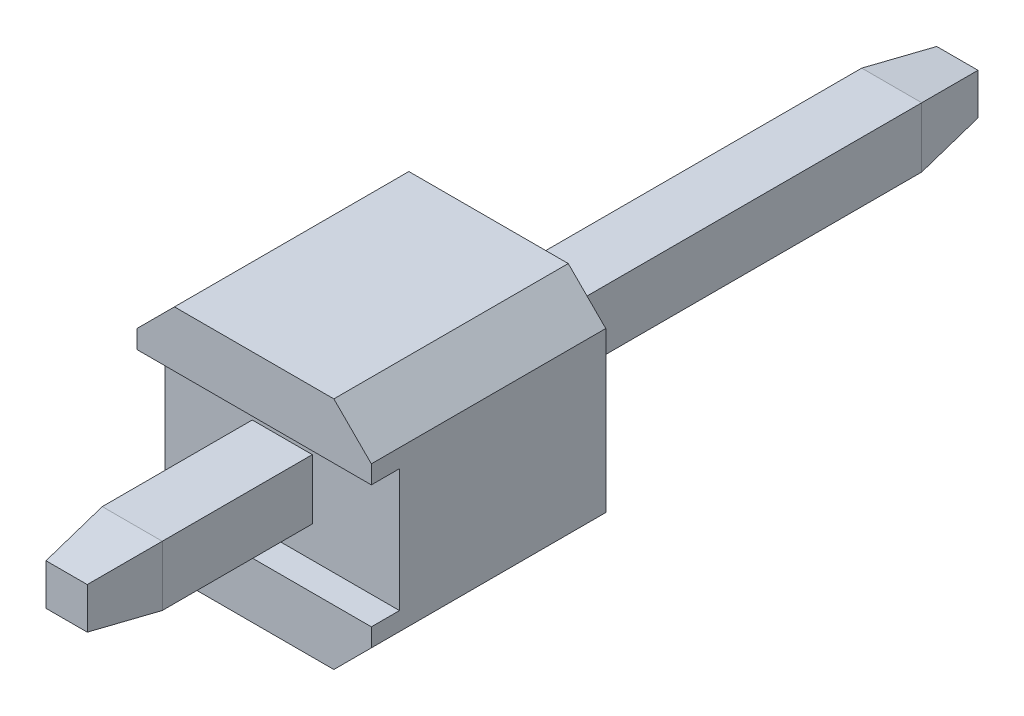
ISO-10303-21;
HEADER;
FILE_DESCRIPTION(('STEP AP214'),'2;1');
FILE_NAME('part.step','',(''),(''),'','','');
FILE_SCHEMA(('AUTOMOTIVE_DESIGN { 1 0 10303 214 1 1 1 1 }'));
ENDSEC;
DATA;
#1=APPLICATION_CONTEXT('core data for automotive mechanical design processes');
#2=APPLICATION_PROTOCOL_DEFINITION('international standard','automotive_design',2000,#1);
#3=PRODUCT_CONTEXT('',#1,'mechanical');
#4=PRODUCT('Part','Part','',(#3));
#5=PRODUCT_RELATED_PRODUCT_CATEGORY('part','',(#4));
#6=PRODUCT_DEFINITION_FORMATION('','',#4);
#7=PRODUCT_DEFINITION_CONTEXT('part definition',#1,'design');
#8=PRODUCT_DEFINITION('design','',#6,#7);
#9=PRODUCT_DEFINITION_SHAPE('','',#8);
#10=(LENGTH_UNIT() NAMED_UNIT(*) SI_UNIT(.MILLI.,.METRE.));
#11=(NAMED_UNIT(*) PLANE_ANGLE_UNIT() SI_UNIT($,.RADIAN.));
#12=(NAMED_UNIT(*) SI_UNIT($,.STERADIAN.) SOLID_ANGLE_UNIT());
#13=UNCERTAINTY_MEASURE_WITH_UNIT(LENGTH_MEASURE(1.E-05),#10,'distance_accuracy_value','');
#14=(GEOMETRIC_REPRESENTATION_CONTEXT(3) GLOBAL_UNCERTAINTY_ASSIGNED_CONTEXT((#13)) GLOBAL_UNIT_ASSIGNED_CONTEXT((#10,
#11,#12)) REPRESENTATION_CONTEXT('',''));
#15=CARTESIAN_POINT('',(0.,0.,0.));
#16=DIRECTION('',(0.,0.,1.));
#17=DIRECTION('',(1.,0.,0.));
#18=AXIS2_PLACEMENT_3D('',#15,#16,#17);
#19=CARTESIAN_POINT('',(-0.16,-0.27,-4.65));
#20=DIRECTION('',(0.,-0.989949493661167,-0.14142135623731));
#21=DIRECTION('',(0.,0.14142135623731,-0.989949493661167));
#22=AXIS2_PLACEMENT_3D('',#19,#20,#21);
#23=PLANE('',#22);
#24=DIRECTION('',(1.,0.,0.));
#25=VECTOR('',#24,1.);
#26=CARTESIAN_POINT('',(-0.16,-0.22,-5.));
#27=LINE('',#26,#25);
#28=CARTESIAN_POINT('',(-0.22,-0.22,-5.));
#29=VERTEX_POINT('',#28);
#30=CARTESIAN_POINT('',(0.22,-0.22,-5.));
#31=VERTEX_POINT('',#30);
#32=EDGE_CURVE('P0_E11',#29,#31,#27,.T.);
#33=ORIENTED_EDGE('',*,*,#32,.T.);
#34=DIRECTION('',(0.140028008402801,-0.140028008402801,0.980196058819607));
#35=VECTOR('',#34,1.);
#36=CARTESIAN_POINT('',(0.22,-0.22,-5.));
#37=LINE('',#36,#35);
#38=CARTESIAN_POINT('',(0.32,-0.32,-4.3));
#39=VERTEX_POINT('',#38);
#40=EDGE_CURVE('P0_E28',#31,#39,#37,.T.);
#41=ORIENTED_EDGE('',*,*,#40,.T.);
#42=DIRECTION('',(-1.,0.,0.));
#43=VECTOR('',#42,1.);
#44=CARTESIAN_POINT('',(-0.16,-0.32,-4.3));
#45=LINE('',#44,#43);
#46=CARTESIAN_POINT('',(-0.32,-0.32,-4.3));
#47=VERTEX_POINT('',#46);
#48=EDGE_CURVE('P0_E90',#39,#47,#45,.T.);
#49=ORIENTED_EDGE('',*,*,#48,.T.);
#50=DIRECTION('',(-0.140028008402801,-0.140028008402801,0.980196058819607));
#51=VECTOR('',#50,1.);
#52=CARTESIAN_POINT('',(-0.22,-0.22,-5.));
#53=LINE('',#52,#51);
#54=EDGE_CURVE('P0_E64',#29,#47,#53,.T.);
#55=ORIENTED_EDGE('',*,*,#54,.F.);
#56=EDGE_LOOP('',(#33,#41,#49,#55));
#57=FACE_BOUND('',#56,.T.);
#58=ADVANCED_FACE('P0_F17',(#57),#23,.T.);
#59=CARTESIAN_POINT('',(0.27,-0.16,-4.65));
#60=DIRECTION('',(0.989949493661167,0.,-0.14142135623731));
#61=DIRECTION('',(0.,-1.,0.));
#62=AXIS2_PLACEMENT_3D('',#59,#60,#61);
#63=PLANE('',#62);
#64=DIRECTION('',(0.,1.,0.));
#65=VECTOR('',#64,1.);
#66=CARTESIAN_POINT('',(0.22,-0.16,-5.));
#67=LINE('',#66,#65);
#68=CARTESIAN_POINT('',(0.22,0.22,-5.));
#69=VERTEX_POINT('',#68);
#70=EDGE_CURVE('P0_E95',#31,#69,#67,.T.);
#71=ORIENTED_EDGE('',*,*,#70,.T.);
#72=DIRECTION('',(0.140028008402801,0.140028008402801,0.980196058819607));
#73=VECTOR('',#72,1.);
#74=CARTESIAN_POINT('',(0.22,0.22,-5.));
#75=LINE('',#74,#73);
#76=CARTESIAN_POINT('',(0.32,0.32,-4.3));
#77=VERTEX_POINT('',#76);
#78=EDGE_CURVE('P0_E130',#69,#77,#75,.T.);
#79=ORIENTED_EDGE('',*,*,#78,.T.);
#80=DIRECTION('',(0.,-1.,0.));
#81=VECTOR('',#80,1.);
#82=CARTESIAN_POINT('',(0.32,-0.16,-4.3));
#83=LINE('',#82,#81);
#84=EDGE_CURVE('P0_E139',#77,#39,#83,.T.);
#85=ORIENTED_EDGE('',*,*,#84,.T.);
#86=ORIENTED_EDGE('',*,*,#40,.F.);
#87=EDGE_LOOP('',(#71,#79,#85,#86));
#88=FACE_BOUND('',#87,.T.);
#89=ADVANCED_FACE('P0_F256',(#88),#63,.T.);
#90=CARTESIAN_POINT('',(0.16,0.27,-4.65));
#91=DIRECTION('',(0.,0.989949493661167,-0.14142135623731));
#92=DIRECTION('',(-1.,0.,0.));
#93=AXIS2_PLACEMENT_3D('',#90,#91,#92);
#94=PLANE('',#93);
#95=DIRECTION('',(-1.,0.,0.));
#96=VECTOR('',#95,1.);
#97=CARTESIAN_POINT('',(0.16,0.22,-5.));
#98=LINE('',#97,#96);
#99=CARTESIAN_POINT('',(-0.22,0.22,-5.));
#100=VERTEX_POINT('',#99);
#101=EDGE_CURVE('P0_E146',#69,#100,#98,.T.);
#102=ORIENTED_EDGE('',*,*,#101,.T.);
#103=DIRECTION('',(-0.140028008402801,0.140028008402801,0.980196058819607));
#104=VECTOR('',#103,1.);
#105=CARTESIAN_POINT('',(-0.22,0.22,-5.));
#106=LINE('',#105,#104);
#107=CARTESIAN_POINT('',(-0.32,0.32,-4.3));
#108=VERTEX_POINT('',#107);
#109=EDGE_CURVE('P0_E154',#100,#108,#106,.T.);
#110=ORIENTED_EDGE('',*,*,#109,.T.);
#111=DIRECTION('',(1.,0.,0.));
#112=VECTOR('',#111,1.);
#113=CARTESIAN_POINT('',(0.16,0.32,-4.3));
#114=LINE('',#113,#112);
#115=EDGE_CURVE('P0_E87',#108,#77,#114,.T.);
#116=ORIENTED_EDGE('',*,*,#115,.T.);
#117=ORIENTED_EDGE('',*,*,#78,.F.);
#118=EDGE_LOOP('',(#102,#110,#116,#117));
#119=FACE_BOUND('',#118,.T.);
#120=ADVANCED_FACE('P0_F264',(#119),#94,.T.);
#121=CARTESIAN_POINT('',(-0.27,0.16,-4.65));
#122=DIRECTION('',(-0.989949493661167,0.,-0.14142135623731));
#123=DIRECTION('',(-0.14142135623731,0.,0.989949493661167));
#124=AXIS2_PLACEMENT_3D('',#121,#122,#123);
#125=PLANE('',#124);
#126=DIRECTION('',(0.,1.,0.));
#127=VECTOR('',#126,1.);
#128=CARTESIAN_POINT('',(-0.32,0.16,-4.3));
#129=LINE('',#128,#127);
#130=EDGE_CURVE('P0_E68',#47,#108,#129,.T.);
#131=ORIENTED_EDGE('',*,*,#130,.T.);
#132=ORIENTED_EDGE('',*,*,#109,.F.);
#133=DIRECTION('',(0.,-1.,0.));
#134=VECTOR('',#133,1.);
#135=CARTESIAN_POINT('',(-0.22,0.16,-5.));
#136=LINE('',#135,#134);
#137=EDGE_CURVE('P0_E71',#100,#29,#136,.T.);
#138=ORIENTED_EDGE('',*,*,#137,.T.);
#139=ORIENTED_EDGE('',*,*,#54,.T.);
#140=EDGE_LOOP('',(#131,#132,#138,#139));
#141=FACE_BOUND('',#140,.T.);
#142=ADVANCED_FACE('P0_F66',(#141),#125,.T.);
#143=CARTESIAN_POINT('',(-0.32,0.32,0.));
#144=DIRECTION('',(-1.,0.,0.));
#145=DIRECTION('',(0.,0.,1.));
#146=AXIS2_PLACEMENT_3D('',#143,#144,#145);
#147=PLANE('',#146);
#148=ORIENTED_EDGE('',*,*,#130,.F.);
#149=DIRECTION('',(0.,0.,1.));
#150=VECTOR('',#149,1.);
#151=CARTESIAN_POINT('',(-0.32,-0.32,0.));
#152=LINE('',#151,#150);
#153=CARTESIAN_POINT('',(-0.32,-0.32,2.));
#154=VERTEX_POINT('',#153);
#155=EDGE_CURVE('P0_E76',#47,#154,#152,.T.);
#156=ORIENTED_EDGE('',*,*,#155,.T.);
#157=DIRECTION('',(0.,-1.,0.));
#158=VECTOR('',#157,1.);
#159=CARTESIAN_POINT('',(-0.32,0.16,2.));
#160=LINE('',#159,#158);
#161=CARTESIAN_POINT('',(-0.32,0.32,2.));
#162=VERTEX_POINT('',#161);
#163=EDGE_CURVE('P0_E109',#162,#154,#160,.T.);
#164=ORIENTED_EDGE('',*,*,#163,.F.);
#165=DIRECTION('',(0.,0.,1.));
#166=VECTOR('',#165,1.);
#167=CARTESIAN_POINT('',(-0.32,0.32,0.));
#168=LINE('',#167,#166);
#169=EDGE_CURVE('P0_E21',#108,#162,#168,.T.);
#170=ORIENTED_EDGE('',*,*,#169,.F.);
#171=EDGE_LOOP('',(#148,#156,#164,#170));
#172=FACE_BOUND('',#171,.T.);
#173=ADVANCED_FACE('P0_F81',(#172),#147,.T.);
#174=CARTESIAN_POINT('',(-0.32,-0.32,0.));
#175=DIRECTION('',(0.,-1.,0.));
#176=DIRECTION('',(0.,0.,-1.));
#177=AXIS2_PLACEMENT_3D('',#174,#175,#176);
#178=PLANE('',#177);
#179=ORIENTED_EDGE('',*,*,#48,.F.);
#180=DIRECTION('',(0.,0.,1.));
#181=VECTOR('',#180,1.);
#182=CARTESIAN_POINT('',(0.32,-0.32,0.));
#183=LINE('',#182,#181);
#184=CARTESIAN_POINT('',(0.32,-0.32,2.));
#185=VERTEX_POINT('',#184);
#186=EDGE_CURVE('P0_E100',#39,#185,#183,.T.);
#187=ORIENTED_EDGE('',*,*,#186,.T.);
#188=DIRECTION('',(1.,0.,0.));
#189=VECTOR('',#188,1.);
#190=CARTESIAN_POINT('',(-0.16,-0.32,2.));
#191=LINE('',#190,#189);
#192=EDGE_CURVE('P0_E98',#154,#185,#191,.T.);
#193=ORIENTED_EDGE('',*,*,#192,.F.);
#194=ORIENTED_EDGE('',*,*,#155,.F.);
#195=EDGE_LOOP('',(#179,#187,#193,#194));
#196=FACE_BOUND('',#195,.T.);
#197=ADVANCED_FACE('P0_F96',(#196),#178,.T.);
#198=CARTESIAN_POINT('',(0.,0.,-5.));
#199=DIRECTION('',(0.,0.,-1.));
#200=DIRECTION('',(0.,-1.,0.));
#201=AXIS2_PLACEMENT_3D('',#198,#199,#200);
#202=PLANE('',#201);
#203=ORIENTED_EDGE('',*,*,#32,.F.);
#204=ORIENTED_EDGE('',*,*,#137,.F.);
#205=ORIENTED_EDGE('',*,*,#101,.F.);
#206=ORIENTED_EDGE('',*,*,#70,.F.);
#207=EDGE_LOOP('',(#203,#204,#205,#206));
#208=FACE_BOUND('',#207,.T.);
#209=ADVANCED_FACE('P0_F247',(#208),#202,.T.);
#210=CARTESIAN_POINT('',(0.32,-0.32,0.));
#211=DIRECTION('',(1.,0.,0.));
#212=DIRECTION('',(0.,1.,0.));
#213=AXIS2_PLACEMENT_3D('',#210,#211,#212);
#214=PLANE('',#213);
#215=ORIENTED_EDGE('',*,*,#84,.F.);
#216=DIRECTION('',(0.,0.,-1.));
#217=VECTOR('',#216,1.);
#218=CARTESIAN_POINT('',(0.32,0.32,0.));
#219=LINE('',#218,#217);
#220=CARTESIAN_POINT('',(0.32,0.32,2.));
#221=VERTEX_POINT('',#220);
#222=EDGE_CURVE('P0_E182',#221,#77,#219,.T.);
#223=ORIENTED_EDGE('',*,*,#222,.F.);
#224=DIRECTION('',(0.,1.,0.));
#225=VECTOR('',#224,1.);
#226=CARTESIAN_POINT('',(0.32,-0.16,2.));
#227=LINE('',#226,#225);
#228=EDGE_CURVE('P0_E197',#185,#221,#227,.T.);
#229=ORIENTED_EDGE('',*,*,#228,.F.);
#230=ORIENTED_EDGE('',*,*,#186,.F.);
#231=EDGE_LOOP('',(#215,#223,#229,#230));
#232=FACE_BOUND('',#231,.T.);
#233=ADVANCED_FACE('P0_F206',(#232),#214,.T.);
#234=CARTESIAN_POINT('',(0.32,0.32,0.));
#235=DIRECTION('',(0.,1.,0.));
#236=DIRECTION('',(1.,0.,0.));
#237=AXIS2_PLACEMENT_3D('',#234,#235,#236);
#238=PLANE('',#237);
#239=ORIENTED_EDGE('',*,*,#115,.F.);
#240=ORIENTED_EDGE('',*,*,#169,.T.);
#241=DIRECTION('',(-1.,0.,0.));
#242=VECTOR('',#241,1.);
#243=CARTESIAN_POINT('',(0.16,0.32,2.));
#244=LINE('',#243,#242);
#245=EDGE_CURVE('P0_E112',#221,#162,#244,.T.);
#246=ORIENTED_EDGE('',*,*,#245,.F.);
#247=ORIENTED_EDGE('',*,*,#222,.T.);
#248=EDGE_LOOP('',(#239,#240,#246,#247));
#249=FACE_BOUND('',#248,.T.);
#250=ADVANCED_FACE('P0_F207',(#249),#238,.T.);
#251=CARTESIAN_POINT('',(0.,0.,2.));
#252=DIRECTION('',(0.,0.,1.));
#253=DIRECTION('',(1.,0.,0.));
#254=AXIS2_PLACEMENT_3D('',#251,#252,#253);
#255=PLANE('',#254);
#256=ORIENTED_EDGE('',*,*,#245,.T.);
#257=ORIENTED_EDGE('',*,*,#163,.T.);
#258=ORIENTED_EDGE('',*,*,#192,.T.);
#259=ORIENTED_EDGE('',*,*,#228,.T.);
#260=EDGE_LOOP('',(#256,#257,#258,#259));
#261=FACE_BOUND('',#260,.T.);
#262=ADVANCED_FACE('P0_F19',(#261),#255,.T.);
#263=CLOSED_SHELL('',(#58,#89,#120,#142,#173,#197,#209,#233,#250,#262));
#264=MANIFOLD_SOLID_BREP('P0_B1',#263);
#265=CARTESIAN_POINT('',(-1.25,0.655430015301126,2.5));
#266=DIRECTION('',(0.,1.,0.));
#267=DIRECTION('',(1.,0.,0.));
#268=AXIS2_PLACEMENT_3D('',#265,#266,#267);
#269=PLANE('',#268);
#270=DIRECTION('',(1.,0.,0.));
#271=VECTOR('',#270,1.);
#272=CARTESIAN_POINT('',(-0.625,0.655430015301126,2.5));
#273=LINE('',#272,#271);
#274=CARTESIAN_POINT('',(-1.25,0.655430015301126,2.5));
#275=VERTEX_POINT('',#274);
#276=CARTESIAN_POINT('',(1.25,0.655430015301126,2.5));
#277=VERTEX_POINT('',#276);
#278=EDGE_CURVE('P1_E199',#275,#277,#273,.T.);
#279=ORIENTED_EDGE('',*,*,#278,.F.);
#280=DIRECTION('',(0.,0.,1.));
#281=VECTOR('',#280,1.);
#282=CARTESIAN_POINT('',(-1.25,0.655430015301126,1.25));
#283=LINE('',#282,#281);
#284=CARTESIAN_POINT('',(-1.25,0.655430015301126,2.2));
#285=VERTEX_POINT('',#284);
#286=EDGE_CURVE('P1_E42',#285,#275,#283,.T.);
#287=ORIENTED_EDGE('',*,*,#286,.F.);
#288=DIRECTION('',(1.,0.,0.));
#289=VECTOR('',#288,1.);
#290=CARTESIAN_POINT('',(-1.25,0.655430015301126,2.2));
#291=LINE('',#290,#289);
#292=CARTESIAN_POINT('',(1.25,0.655430015301126,2.2));
#293=VERTEX_POINT('',#292);
#294=EDGE_CURVE('P1_E11',#285,#293,#291,.T.);
#295=ORIENTED_EDGE('',*,*,#294,.T.);
#296=DIRECTION('',(0.,0.,-1.));
#297=VECTOR('',#296,1.);
#298=CARTESIAN_POINT('',(1.25,0.655430015301126,1.25));
#299=LINE('',#298,#297);
#300=EDGE_CURVE('P1_E247',#277,#293,#299,.T.);
#301=ORIENTED_EDGE('',*,*,#300,.F.);
#302=EDGE_LOOP('',(#279,#287,#295,#301));
#303=FACE_BOUND('',#302,.T.);
#304=ADVANCED_FACE('P1_F17',(#303),#269,.F.);
#305=CARTESIAN_POINT('',(1.25,-0.655430015301126,2.5));
#306=DIRECTION('',(0.,-1.,0.));
#307=DIRECTION('',(0.,0.,-1.));
#308=AXIS2_PLACEMENT_3D('',#305,#306,#307);
#309=PLANE('',#308);
#310=DIRECTION('',(-1.,0.,0.));
#311=VECTOR('',#310,1.);
#312=CARTESIAN_POINT('',(0.625,-0.655430015301126,2.5));
#313=LINE('',#312,#311);
#314=CARTESIAN_POINT('',(1.25,-0.655430015301126,2.5));
#315=VERTEX_POINT('',#314);
#316=CARTESIAN_POINT('',(-1.25,-0.655430015301126,2.5));
#317=VERTEX_POINT('',#316);
#318=EDGE_CURVE('P1_E185',#315,#317,#313,.T.);
#319=ORIENTED_EDGE('',*,*,#318,.F.);
#320=DIRECTION('',(0.,0.,1.));
#321=VECTOR('',#320,1.);
#322=CARTESIAN_POINT('',(1.25,-0.655430015301126,1.25));
#323=LINE('',#322,#321);
#324=CARTESIAN_POINT('',(1.25,-0.655430015301126,2.2));
#325=VERTEX_POINT('',#324);
#326=EDGE_CURVE('P1_E166',#325,#315,#323,.T.);
#327=ORIENTED_EDGE('',*,*,#326,.F.);
#328=DIRECTION('',(-1.,0.,0.));
#329=VECTOR('',#328,1.);
#330=CARTESIAN_POINT('',(1.25,-0.655430015301126,2.2));
#331=LINE('',#330,#329);
#332=CARTESIAN_POINT('',(-1.25,-0.655430015301126,2.2));
#333=VERTEX_POINT('',#332);
#334=EDGE_CURVE('P1_E28',#325,#333,#331,.T.);
#335=ORIENTED_EDGE('',*,*,#334,.T.);
#336=DIRECTION('',(0.,0.,-1.));
#337=VECTOR('',#336,1.);
#338=CARTESIAN_POINT('',(-1.25,-0.655430015301126,1.25));
#339=LINE('',#338,#337);
#340=EDGE_CURVE('P1_E187',#317,#333,#339,.T.);
#341=ORIENTED_EDGE('',*,*,#340,.F.);
#342=EDGE_LOOP('',(#319,#327,#335,#341));
#343=FACE_BOUND('',#342,.T.);
#344=ADVANCED_FACE('P1_F186',(#343),#309,.F.);
#345=CARTESIAN_POINT('',(0.,0.,2.2));
#346=DIRECTION('',(0.,0.,-1.));
#347=DIRECTION('',(0.,-1.,0.));
#348=AXIS2_PLACEMENT_3D('',#345,#346,#347);
#349=PLANE('',#348);
#350=DIRECTION('',(0.,-1.,0.));
#351=VECTOR('',#350,1.);
#352=CARTESIAN_POINT('',(1.25,-0.625,2.2));
#353=LINE('',#352,#351);
#354=EDGE_CURVE('P1_E179',#293,#325,#353,.T.);
#355=ORIENTED_EDGE('',*,*,#354,.F.);
#356=ORIENTED_EDGE('',*,*,#294,.F.);
#357=DIRECTION('',(0.,1.,0.));
#358=VECTOR('',#357,1.);
#359=CARTESIAN_POINT('',(-1.25,0.625,2.2));
#360=LINE('',#359,#358);
#361=EDGE_CURVE('P1_E262',#333,#285,#360,.T.);
#362=ORIENTED_EDGE('',*,*,#361,.F.);
#363=ORIENTED_EDGE('',*,*,#334,.F.);
#364=EDGE_LOOP('',(#355,#356,#362,#363));
#365=FACE_BOUND('',#364,.T.);
#366=DIRECTION('',(0.,-1.,0.));
#367=VECTOR('',#366,1.);
#368=CARTESIAN_POINT('',(-0.32,-0.16,2.2));
#369=LINE('',#368,#367);
#370=CARTESIAN_POINT('',(-0.32,0.32,2.2));
#371=VERTEX_POINT('',#370);
#372=CARTESIAN_POINT('',(-0.32,-0.32,2.2));
#373=VERTEX_POINT('',#372);
#374=EDGE_CURVE('P1_E231',#371,#373,#369,.T.);
#375=ORIENTED_EDGE('',*,*,#374,.F.);
#376=DIRECTION('',(-1.,0.,0.));
#377=VECTOR('',#376,1.);
#378=CARTESIAN_POINT('',(-0.16,0.32,2.2));
#379=LINE('',#378,#377);
#380=CARTESIAN_POINT('',(0.32,0.32,2.2));
#381=VERTEX_POINT('',#380);
#382=EDGE_CURVE('P1_E268',#381,#371,#379,.T.);
#383=ORIENTED_EDGE('',*,*,#382,.F.);
#384=DIRECTION('',(0.,1.,0.));
#385=VECTOR('',#384,1.);
#386=CARTESIAN_POINT('',(0.32,0.16,2.2));
#387=LINE('',#386,#385);
#388=CARTESIAN_POINT('',(0.32,-0.32,2.2));
#389=VERTEX_POINT('',#388);
#390=EDGE_CURVE('P1_E181',#389,#381,#387,.T.);
#391=ORIENTED_EDGE('',*,*,#390,.F.);
#392=DIRECTION('',(1.,0.,0.));
#393=VECTOR('',#392,1.);
#394=CARTESIAN_POINT('',(0.16,-0.32,2.2));
#395=LINE('',#394,#393);
#396=EDGE_CURVE('P1_E346',#373,#389,#395,.T.);
#397=ORIENTED_EDGE('',*,*,#396,.F.);
#398=EDGE_LOOP('',(#375,#383,#391,#397));
#399=FACE_BOUND('',#398,.T.);
#400=ADVANCED_FACE('P1_F380',(#365,#399),#349,.F.);
#401=CARTESIAN_POINT('',(0.,0.,2.5));
#402=DIRECTION('',(0.,0.,1.));
#403=DIRECTION('',(1.,0.,0.));
#404=AXIS2_PLACEMENT_3D('',#401,#402,#403);
#405=PLANE('',#404);
#406=ORIENTED_EDGE('',*,*,#318,.T.);
#407=DIRECTION('',(0.,-1.,0.));
#408=VECTOR('',#407,1.);
#409=CARTESIAN_POINT('',(-1.25,-1.25,2.5));
#410=LINE('',#409,#408);
#411=CARTESIAN_POINT('',(-1.25,-0.85,2.5));
#412=VERTEX_POINT('',#411);
#413=EDGE_CURVE('P1_E192',#317,#412,#410,.T.);
#414=ORIENTED_EDGE('',*,*,#413,.T.);
#415=DIRECTION('',(-0.707106781186548,0.707106781186548,0.));
#416=VECTOR('',#415,1.);
#417=CARTESIAN_POINT('',(-1.05,-1.05,2.5));
#418=LINE('',#417,#416);
#419=CARTESIAN_POINT('',(-0.85,-1.25,2.5));
#420=VERTEX_POINT('',#419);
#421=EDGE_CURVE('P1_E263',#420,#412,#418,.T.);
#422=ORIENTED_EDGE('',*,*,#421,.F.);
#423=DIRECTION('',(1.,0.,0.));
#424=VECTOR('',#423,1.);
#425=CARTESIAN_POINT('',(1.25,-1.25,2.5));
#426=LINE('',#425,#424);
#427=CARTESIAN_POINT('',(0.85,-1.25,2.5));
#428=VERTEX_POINT('',#427);
#429=EDGE_CURVE('P1_E198',#420,#428,#426,.T.);
#430=ORIENTED_EDGE('',*,*,#429,.T.);
#431=DIRECTION('',(-0.707106781186548,-0.707106781186548,0.));
#432=VECTOR('',#431,1.);
#433=CARTESIAN_POINT('',(1.05,-1.05,2.5));
#434=LINE('',#433,#432);
#435=CARTESIAN_POINT('',(1.25,-0.85,2.5));
#436=VERTEX_POINT('',#435);
#437=EDGE_CURVE('P1_E196',#436,#428,#434,.T.);
#438=ORIENTED_EDGE('',*,*,#437,.F.);
#439=DIRECTION('',(0.,1.,0.));
#440=VECTOR('',#439,1.);
#441=CARTESIAN_POINT('',(1.25,1.25,2.5));
#442=LINE('',#441,#440);
#443=EDGE_CURVE('P1_E176',#436,#315,#442,.T.);
#444=ORIENTED_EDGE('',*,*,#443,.T.);
#445=EDGE_LOOP('',(#406,#414,#422,#430,#438,#444));
#446=FACE_BOUND('',#445,.T.);
#447=ADVANCED_FACE('P1_F194',(#446),#405,.T.);
#448=CARTESIAN_POINT('',(0.,0.,2.5));
#449=DIRECTION('',(0.,0.,1.));
#450=DIRECTION('',(1.,0.,0.));
#451=AXIS2_PLACEMENT_3D('',#448,#449,#450);
#452=PLANE('',#451);
#453=ORIENTED_EDGE('',*,*,#278,.T.);
#454=DIRECTION('',(0.,1.,0.));
#455=VECTOR('',#454,1.);
#456=CARTESIAN_POINT('',(1.25,1.25,2.5));
#457=LINE('',#456,#455);
#458=CARTESIAN_POINT('',(1.25,0.85,2.5));
#459=VERTEX_POINT('',#458);
#460=EDGE_CURVE('P1_E208',#277,#459,#457,.T.);
#461=ORIENTED_EDGE('',*,*,#460,.T.);
#462=DIRECTION('',(0.707106781186548,-0.707106781186548,0.));
#463=VECTOR('',#462,1.);
#464=CARTESIAN_POINT('',(1.05,1.05,2.5));
#465=LINE('',#464,#463);
#466=CARTESIAN_POINT('',(0.85,1.25,2.5));
#467=VERTEX_POINT('',#466);
#468=EDGE_CURVE('P1_E223',#467,#459,#465,.T.);
#469=ORIENTED_EDGE('',*,*,#468,.F.);
#470=DIRECTION('',(-1.,0.,0.));
#471=VECTOR('',#470,1.);
#472=CARTESIAN_POINT('',(-1.25,1.25,2.5));
#473=LINE('',#472,#471);
#474=CARTESIAN_POINT('',(-0.85,1.25,2.5));
#475=VERTEX_POINT('',#474);
#476=EDGE_CURVE('P1_E246',#467,#475,#473,.T.);
#477=ORIENTED_EDGE('',*,*,#476,.T.);
#478=DIRECTION('',(0.707106781186548,0.707106781186548,0.));
#479=VECTOR('',#478,1.);
#480=CARTESIAN_POINT('',(-1.05,1.05,2.5));
#481=LINE('',#480,#479);
#482=CARTESIAN_POINT('',(-1.25,0.85,2.5));
#483=VERTEX_POINT('',#482);
#484=EDGE_CURVE('P1_E213',#483,#475,#481,.T.);
#485=ORIENTED_EDGE('',*,*,#484,.F.);
#486=DIRECTION('',(0.,-1.,0.));
#487=VECTOR('',#486,1.);
#488=CARTESIAN_POINT('',(-1.25,-1.25,2.5));
#489=LINE('',#488,#487);
#490=EDGE_CURVE('P1_E243',#483,#275,#489,.T.);
#491=ORIENTED_EDGE('',*,*,#490,.T.);
#492=EDGE_LOOP('',(#453,#461,#469,#477,#485,#491));
#493=FACE_BOUND('',#492,.T.);
#494=ADVANCED_FACE('P1_F523',(#493),#452,.T.);
#495=CARTESIAN_POINT('',(1.25,-1.25,0.));
#496=DIRECTION('',(1.,0.,0.));
#497=DIRECTION('',(0.,1.,0.));
#498=AXIS2_PLACEMENT_3D('',#495,#496,#497);
#499=PLANE('',#498);
#500=ORIENTED_EDGE('',*,*,#300,.T.);
#501=ORIENTED_EDGE('',*,*,#354,.T.);
#502=ORIENTED_EDGE('',*,*,#326,.T.);
#503=ORIENTED_EDGE('',*,*,#443,.F.);
#504=DIRECTION('',(0.,0.,1.));
#505=VECTOR('',#504,1.);
#506=CARTESIAN_POINT('',(1.25,-0.85,0.));
#507=LINE('',#506,#505);
#508=CARTESIAN_POINT('',(1.25,-0.85,0.));
#509=VERTEX_POINT('',#508);
#510=EDGE_CURVE('P1_E286',#509,#436,#507,.T.);
#511=ORIENTED_EDGE('',*,*,#510,.F.);
#512=DIRECTION('',(0.,-1.,0.));
#513=VECTOR('',#512,1.);
#514=CARTESIAN_POINT('',(1.25,1.25,0.));
#515=LINE('',#514,#513);
#516=CARTESIAN_POINT('',(1.25,0.85,0.));
#517=VERTEX_POINT('',#516);
#518=EDGE_CURVE('P1_E218',#517,#509,#515,.T.);
#519=ORIENTED_EDGE('',*,*,#518,.F.);
#520=DIRECTION('',(0.,0.,-1.));
#521=VECTOR('',#520,1.);
#522=CARTESIAN_POINT('',(1.25,0.85,0.));
#523=LINE('',#522,#521);
#524=EDGE_CURVE('P1_E21',#459,#517,#523,.T.);
#525=ORIENTED_EDGE('',*,*,#524,.F.);
#526=ORIENTED_EDGE('',*,*,#460,.F.);
#527=EDGE_LOOP('',(#500,#501,#502,#503,#511,#519,#525,#526));
#528=FACE_BOUND('',#527,.T.);
#529=ADVANCED_FACE('P1_F174',(#528),#499,.T.);
#530=CARTESIAN_POINT('',(0.32,0.32,0.));
#531=DIRECTION('',(-1.,0.,0.));
#532=DIRECTION('',(0.,0.,1.));
#533=AXIS2_PLACEMENT_3D('',#530,#531,#532);
#534=PLANE('',#533);
#535=ORIENTED_EDGE('',*,*,#390,.T.);
#536=DIRECTION('',(0.,0.,1.));
#537=VECTOR('',#536,1.);
#538=CARTESIAN_POINT('',(0.32,0.32,0.));
#539=LINE('',#538,#537);
#540=CARTESIAN_POINT('',(0.32,0.32,0.));
#541=VERTEX_POINT('',#540);
#542=EDGE_CURVE('P1_E266',#541,#381,#539,.T.);
#543=ORIENTED_EDGE('',*,*,#542,.F.);
#544=DIRECTION('',(0.,-1.,0.));
#545=VECTOR('',#544,1.);
#546=CARTESIAN_POINT('',(0.32,0.32,0.));
#547=LINE('',#546,#545);
#548=CARTESIAN_POINT('',(0.32,-0.32,0.));
#549=VERTEX_POINT('',#548);
#550=EDGE_CURVE('P1_E290',#541,#549,#547,.T.);
#551=ORIENTED_EDGE('',*,*,#550,.T.);
#552=DIRECTION('',(0.,0.,1.));
#553=VECTOR('',#552,1.);
#554=CARTESIAN_POINT('',(0.32,-0.32,0.));
#555=LINE('',#554,#553);
#556=EDGE_CURVE('P1_E271',#549,#389,#555,.T.);
#557=ORIENTED_EDGE('',*,*,#556,.T.);
#558=EDGE_LOOP('',(#535,#543,#551,#557));
#559=FACE_BOUND('',#558,.T.);
#560=ADVANCED_FACE('P1_F382',(#559),#534,.T.);
#561=CARTESIAN_POINT('',(-0.32,0.32,0.));
#562=DIRECTION('',(0.,-1.,0.));
#563=DIRECTION('',(0.,0.,-1.));
#564=AXIS2_PLACEMENT_3D('',#561,#562,#563);
#565=PLANE('',#564);
#566=ORIENTED_EDGE('',*,*,#382,.T.);
#567=DIRECTION('',(0.,0.,1.));
#568=VECTOR('',#567,1.);
#569=CARTESIAN_POINT('',(-0.32,0.32,0.));
#570=LINE('',#569,#568);
#571=CARTESIAN_POINT('',(-0.32,0.32,0.));
#572=VERTEX_POINT('',#571);
#573=EDGE_CURVE('P1_E80',#572,#371,#570,.T.);
#574=ORIENTED_EDGE('',*,*,#573,.F.);
#575=DIRECTION('',(1.,0.,0.));
#576=VECTOR('',#575,1.);
#577=CARTESIAN_POINT('',(-0.32,0.32,0.));
#578=LINE('',#577,#576);
#579=EDGE_CURVE('P1_E272',#572,#541,#578,.T.);
#580=ORIENTED_EDGE('',*,*,#579,.T.);
#581=ORIENTED_EDGE('',*,*,#542,.T.);
#582=EDGE_LOOP('',(#566,#574,#580,#581));
#583=FACE_BOUND('',#582,.T.);
#584=ADVANCED_FACE('P1_F381',(#583),#565,.T.);
#585=CARTESIAN_POINT('',(-1.05,-1.05,0.));
#586=DIRECTION('',(-0.707106781186548,-0.707106781186548,0.));
#587=DIRECTION('',(-0.707106781186548,0.707106781186548,0.));
#588=AXIS2_PLACEMENT_3D('',#585,#586,#587);
#589=PLANE('',#588);
#590=ORIENTED_EDGE('',*,*,#421,.T.);
#591=DIRECTION('',(0.,0.,-1.));
#592=VECTOR('',#591,1.);
#593=CARTESIAN_POINT('',(-1.25,-0.85,0.));
#594=LINE('',#593,#592);
#595=CARTESIAN_POINT('',(-1.25,-0.85,0.));
#596=VERTEX_POINT('',#595);
#597=EDGE_CURVE('P1_E267',#412,#596,#594,.T.);
#598=ORIENTED_EDGE('',*,*,#597,.T.);
#599=DIRECTION('',(0.707106781186548,-0.707106781186548,0.));
#600=VECTOR('',#599,1.);
#601=CARTESIAN_POINT('',(-1.05,-1.05,0.));
#602=LINE('',#601,#600);
#603=CARTESIAN_POINT('',(-0.85,-1.25,0.));
#604=VERTEX_POINT('',#603);
#605=EDGE_CURVE('P1_E96',#596,#604,#602,.T.);
#606=ORIENTED_EDGE('',*,*,#605,.T.);
#607=DIRECTION('',(0.,0.,1.));
#608=VECTOR('',#607,1.);
#609=CARTESIAN_POINT('',(-0.85,-1.25,0.));
#610=LINE('',#609,#608);
#611=EDGE_CURVE('P1_E322',#604,#420,#610,.T.);
#612=ORIENTED_EDGE('',*,*,#611,.T.);
#613=EDGE_LOOP('',(#590,#598,#606,#612));
#614=FACE_BOUND('',#613,.T.);
#615=ADVANCED_FACE('P1_F320',(#614),#589,.T.);
#616=CARTESIAN_POINT('',(-1.25,-1.25,0.));
#617=DIRECTION('',(0.,-1.,0.));
#618=DIRECTION('',(0.,0.,-1.));
#619=AXIS2_PLACEMENT_3D('',#616,#617,#618);
#620=PLANE('',#619);
#621=ORIENTED_EDGE('',*,*,#611,.F.);
#622=DIRECTION('',(-1.,0.,0.));
#623=VECTOR('',#622,1.);
#624=CARTESIAN_POINT('',(1.25,-1.25,0.));
#625=LINE('',#624,#623);
#626=CARTESIAN_POINT('',(0.85,-1.25,0.));
#627=VERTEX_POINT('',#626);
#628=EDGE_CURVE('P1_E216',#627,#604,#625,.T.);
#629=ORIENTED_EDGE('',*,*,#628,.F.);
#630=DIRECTION('',(0.,0.,-1.));
#631=VECTOR('',#630,1.);
#632=CARTESIAN_POINT('',(0.85,-1.25,0.));
#633=LINE('',#632,#631);
#634=EDGE_CURVE('P1_E242',#428,#627,#633,.T.);
#635=ORIENTED_EDGE('',*,*,#634,.F.);
#636=ORIENTED_EDGE('',*,*,#429,.F.);
#637=EDGE_LOOP('',(#621,#629,#635,#636));
#638=FACE_BOUND('',#637,.T.);
#639=ADVANCED_FACE('P1_F509',(#638),#620,.T.);
#640=CARTESIAN_POINT('',(0.,0.,0.));
#641=DIRECTION('',(0.,0.,1.));
#642=DIRECTION('',(1.,0.,0.));
#643=AXIS2_PLACEMENT_3D('',#640,#641,#642);
#644=PLANE('',#643);
#645=ORIENTED_EDGE('',*,*,#605,.F.);
#646=DIRECTION('',(0.,1.,0.));
#647=VECTOR('',#646,1.);
#648=CARTESIAN_POINT('',(-1.25,-1.25,0.));
#649=LINE('',#648,#647);
#650=CARTESIAN_POINT('',(-1.25,0.85,0.));
#651=VERTEX_POINT('',#650);
#652=EDGE_CURVE('P1_E258',#596,#651,#649,.T.);
#653=ORIENTED_EDGE('',*,*,#652,.T.);
#654=DIRECTION('',(-0.707106781186548,-0.707106781186548,0.));
#655=VECTOR('',#654,1.);
#656=CARTESIAN_POINT('',(-1.05,1.05,0.));
#657=LINE('',#656,#655);
#658=CARTESIAN_POINT('',(-0.85,1.25,0.));
#659=VERTEX_POINT('',#658);
#660=EDGE_CURVE('P1_E234',#659,#651,#657,.T.);
#661=ORIENTED_EDGE('',*,*,#660,.F.);
#662=DIRECTION('',(1.,0.,0.));
#663=VECTOR('',#662,1.);
#664=CARTESIAN_POINT('',(-1.25,1.25,0.));
#665=LINE('',#664,#663);
#666=CARTESIAN_POINT('',(0.85,1.25,0.));
#667=VERTEX_POINT('',#666);
#668=EDGE_CURVE('P1_E222',#659,#667,#665,.T.);
#669=ORIENTED_EDGE('',*,*,#668,.T.);
#670=DIRECTION('',(-0.707106781186548,0.707106781186548,0.));
#671=VECTOR('',#670,1.);
#672=CARTESIAN_POINT('',(1.05,1.05,0.));
#673=LINE('',#672,#671);
#674=EDGE_CURVE('P1_E236',#517,#667,#673,.T.);
#675=ORIENTED_EDGE('',*,*,#674,.F.);
#676=ORIENTED_EDGE('',*,*,#518,.T.);
#677=DIRECTION('',(0.707106781186548,0.707106781186548,0.));
#678=VECTOR('',#677,1.);
#679=CARTESIAN_POINT('',(1.05,-1.05,0.));
#680=LINE('',#679,#678);
#681=EDGE_CURVE('P1_E339',#627,#509,#680,.T.);
#682=ORIENTED_EDGE('',*,*,#681,.F.);
#683=ORIENTED_EDGE('',*,*,#628,.T.);
#684=EDGE_LOOP('',(#645,#653,#661,#669,#675,#676,#682,#683));
#685=FACE_BOUND('',#684,.T.);
#686=ORIENTED_EDGE('',*,*,#579,.F.);
#687=DIRECTION('',(0.,1.,0.));
#688=VECTOR('',#687,1.);
#689=CARTESIAN_POINT('',(-0.32,-0.32,0.));
#690=LINE('',#689,#688);
#691=CARTESIAN_POINT('',(-0.32,-0.32,0.));
#692=VERTEX_POINT('',#691);
#693=EDGE_CURVE('P1_E227',#692,#572,#690,.T.);
#694=ORIENTED_EDGE('',*,*,#693,.F.);
#695=DIRECTION('',(-1.,0.,0.));
#696=VECTOR('',#695,1.);
#697=CARTESIAN_POINT('',(0.32,-0.32,0.));
#698=LINE('',#697,#696);
#699=EDGE_CURVE('P1_E343',#549,#692,#698,.T.);
#700=ORIENTED_EDGE('',*,*,#699,.F.);
#701=ORIENTED_EDGE('',*,*,#550,.F.);
#702=EDGE_LOOP('',(#686,#694,#700,#701));
#703=FACE_BOUND('',#702,.T.);
#704=ADVANCED_FACE('P1_F384',(#685,#703),#644,.F.);
#705=CARTESIAN_POINT('',(-1.05,1.05,0.));
#706=DIRECTION('',(-0.707106781186548,0.707106781186548,0.));
#707=DIRECTION('',(0.,0.,1.));
#708=AXIS2_PLACEMENT_3D('',#705,#706,#707);
#709=PLANE('',#708);
#710=ORIENTED_EDGE('',*,*,#484,.T.);
#711=DIRECTION('',(0.,0.,-1.));
#712=VECTOR('',#711,1.);
#713=CARTESIAN_POINT('',(-0.85,1.25,0.));
#714=LINE('',#713,#712);
#715=EDGE_CURVE('P1_E217',#475,#659,#714,.T.);
#716=ORIENTED_EDGE('',*,*,#715,.T.);
#717=ORIENTED_EDGE('',*,*,#660,.T.);
#718=DIRECTION('',(0.,0.,1.));
#719=VECTOR('',#718,1.);
#720=CARTESIAN_POINT('',(-1.25,0.85,0.));
#721=LINE('',#720,#719);
#722=EDGE_CURVE('P1_E226',#651,#483,#721,.T.);
#723=ORIENTED_EDGE('',*,*,#722,.T.);
#724=EDGE_LOOP('',(#710,#716,#717,#723));
#725=FACE_BOUND('',#724,.T.);
#726=ADVANCED_FACE('P1_F19',(#725),#709,.T.);
#727=CARTESIAN_POINT('',(1.25,1.25,0.));
#728=DIRECTION('',(0.,1.,0.));
#729=DIRECTION('',(1.,0.,0.));
#730=AXIS2_PLACEMENT_3D('',#727,#728,#729);
#731=PLANE('',#730);
#732=ORIENTED_EDGE('',*,*,#715,.F.);
#733=ORIENTED_EDGE('',*,*,#476,.F.);
#734=DIRECTION('',(0.,0.,1.));
#735=VECTOR('',#734,1.);
#736=CARTESIAN_POINT('',(0.85,1.25,0.));
#737=LINE('',#736,#735);
#738=EDGE_CURVE('P1_E239',#667,#467,#737,.T.);
#739=ORIENTED_EDGE('',*,*,#738,.F.);
#740=ORIENTED_EDGE('',*,*,#668,.F.);
#741=EDGE_LOOP('',(#732,#733,#739,#740));
#742=FACE_BOUND('',#741,.T.);
#743=ADVANCED_FACE('P1_F544',(#742),#731,.T.);
#744=CARTESIAN_POINT('',(1.05,1.05,0.));
#745=DIRECTION('',(0.707106781186548,0.707106781186548,0.));
#746=DIRECTION('',(0.,0.,-1.));
#747=AXIS2_PLACEMENT_3D('',#744,#745,#746);
#748=PLANE('',#747);
#749=ORIENTED_EDGE('',*,*,#468,.T.);
#750=ORIENTED_EDGE('',*,*,#524,.T.);
#751=ORIENTED_EDGE('',*,*,#674,.T.);
#752=ORIENTED_EDGE('',*,*,#738,.T.);
#753=EDGE_LOOP('',(#749,#750,#751,#752));
#754=FACE_BOUND('',#753,.T.);
#755=ADVANCED_FACE('P1_F549',(#754),#748,.T.);
#756=CARTESIAN_POINT('',(1.05,-1.05,0.));
#757=DIRECTION('',(0.707106781186548,-0.707106781186548,0.));
#758=DIRECTION('',(0.,0.,-1.));
#759=AXIS2_PLACEMENT_3D('',#756,#757,#758);
#760=PLANE('',#759);
#761=ORIENTED_EDGE('',*,*,#437,.T.);
#762=ORIENTED_EDGE('',*,*,#634,.T.);
#763=ORIENTED_EDGE('',*,*,#681,.T.);
#764=ORIENTED_EDGE('',*,*,#510,.T.);
#765=EDGE_LOOP('',(#761,#762,#763,#764));
#766=FACE_BOUND('',#765,.T.);
#767=ADVANCED_FACE('P1_F565',(#766),#760,.T.);
#768=CARTESIAN_POINT('',(-0.32,-0.32,0.));
#769=DIRECTION('',(1.,0.,0.));
#770=DIRECTION('',(0.,1.,0.));
#771=AXIS2_PLACEMENT_3D('',#768,#769,#770);
#772=PLANE('',#771);
#773=ORIENTED_EDGE('',*,*,#374,.T.);
#774=DIRECTION('',(0.,0.,1.));
#775=VECTOR('',#774,1.);
#776=CARTESIAN_POINT('',(-0.32,-0.32,0.));
#777=LINE('',#776,#775);
#778=EDGE_CURVE('P1_E307',#692,#373,#777,.T.);
#779=ORIENTED_EDGE('',*,*,#778,.F.);
#780=ORIENTED_EDGE('',*,*,#693,.T.);
#781=ORIENTED_EDGE('',*,*,#573,.T.);
#782=EDGE_LOOP('',(#773,#779,#780,#781));
#783=FACE_BOUND('',#782,.T.);
#784=ADVANCED_FACE('P1_F378',(#783),#772,.T.);
#785=CARTESIAN_POINT('',(0.32,-0.32,0.));
#786=DIRECTION('',(0.,1.,0.));
#787=DIRECTION('',(1.,0.,0.));
#788=AXIS2_PLACEMENT_3D('',#785,#786,#787);
#789=PLANE('',#788);
#790=ORIENTED_EDGE('',*,*,#396,.T.);
#791=ORIENTED_EDGE('',*,*,#556,.F.);
#792=ORIENTED_EDGE('',*,*,#699,.T.);
#793=ORIENTED_EDGE('',*,*,#778,.T.);
#794=EDGE_LOOP('',(#790,#791,#792,#793));
#795=FACE_BOUND('',#794,.T.);
#796=ADVANCED_FACE('P1_F371',(#795),#789,.T.);
#797=CARTESIAN_POINT('',(-1.25,1.25,0.));
#798=DIRECTION('',(-1.,0.,0.));
#799=DIRECTION('',(0.,0.,1.));
#800=AXIS2_PLACEMENT_3D('',#797,#798,#799);
#801=PLANE('',#800);
#802=ORIENTED_EDGE('',*,*,#286,.T.);
#803=ORIENTED_EDGE('',*,*,#490,.F.);
#804=ORIENTED_EDGE('',*,*,#722,.F.);
#805=ORIENTED_EDGE('',*,*,#652,.F.);
#806=ORIENTED_EDGE('',*,*,#597,.F.);
#807=ORIENTED_EDGE('',*,*,#413,.F.);
#808=ORIENTED_EDGE('',*,*,#340,.T.);
#809=ORIENTED_EDGE('',*,*,#361,.T.);
#810=EDGE_LOOP('',(#802,#803,#804,#805,#806,#807,#808,#809));
#811=FACE_BOUND('',#810,.T.);
#812=ADVANCED_FACE('P1_F317',(#811),#801,.T.);
#813=CLOSED_SHELL('',(#304,#344,#400,#447,#494,#529,#560,#584,#615,#639,#704,#726,#743,#755,
#767,#784,#796,#812));
#814=MANIFOLD_SOLID_BREP('P1_B1',#813);
#815=CARTESIAN_POINT('',(0.27,-0.16,4.15));
#816=DIRECTION('',(0.989949493661167,0.,0.141421356237309));
#817=DIRECTION('',(0.,-1.,0.));
#818=AXIS2_PLACEMENT_3D('',#815,#816,#817);
#819=PLANE('',#818);
#820=DIRECTION('',(0.,-1.,0.));
#821=VECTOR('',#820,1.);
#822=CARTESIAN_POINT('',(0.22,-0.16,4.5));
#823=LINE('',#822,#821);
#824=CARTESIAN_POINT('',(0.22,0.22,4.5));
#825=VERTEX_POINT('',#824);
#826=CARTESIAN_POINT('',(0.22,-0.22,4.5));
#827=VERTEX_POINT('',#826);
#828=EDGE_CURVE('P2_E11',#825,#827,#823,.T.);
#829=ORIENTED_EDGE('',*,*,#828,.T.);
#830=DIRECTION('',(0.140028008402801,-0.140028008402801,-0.980196058819607));
#831=VECTOR('',#830,1.);
#832=CARTESIAN_POINT('',(0.22,-0.22,4.5));
#833=LINE('',#832,#831);
#834=CARTESIAN_POINT('',(0.32,-0.32,3.8));
#835=VERTEX_POINT('',#834);
#836=EDGE_CURVE('P2_E28',#827,#835,#833,.T.);
#837=ORIENTED_EDGE('',*,*,#836,.T.);
#838=DIRECTION('',(0.,1.,0.));
#839=VECTOR('',#838,1.);
#840=CARTESIAN_POINT('',(0.32,-0.16,3.8));
#841=LINE('',#840,#839);
#842=CARTESIAN_POINT('',(0.32,0.32,3.8));
#843=VERTEX_POINT('',#842);
#844=EDGE_CURVE('P2_E120',#835,#843,#841,.T.);
#845=ORIENTED_EDGE('',*,*,#844,.T.);
#846=DIRECTION('',(0.140028008402801,0.140028008402801,-0.980196058819607));
#847=VECTOR('',#846,1.);
#848=CARTESIAN_POINT('',(0.22,0.22,4.5));
#849=LINE('',#848,#847);
#850=EDGE_CURVE('P2_E108',#825,#843,#849,.T.);
#851=ORIENTED_EDGE('',*,*,#850,.F.);
#852=EDGE_LOOP('',(#829,#837,#845,#851));
#853=FACE_BOUND('',#852,.T.);
#854=ADVANCED_FACE('P2_F17',(#853),#819,.T.);
#855=CARTESIAN_POINT('',(-0.16,-0.27,4.15));
#856=DIRECTION('',(0.,-0.989949493661167,0.141421356237309));
#857=DIRECTION('',(-1.,0.,0.));
#858=AXIS2_PLACEMENT_3D('',#855,#856,#857);
#859=PLANE('',#858);
#860=DIRECTION('',(-1.,0.,0.));
#861=VECTOR('',#860,1.);
#862=CARTESIAN_POINT('',(-0.16,-0.22,4.5));
#863=LINE('',#862,#861);
#864=CARTESIAN_POINT('',(-0.22,-0.22,4.5));
#865=VERTEX_POINT('',#864);
#866=EDGE_CURVE('P2_E123',#827,#865,#863,.T.);
#867=ORIENTED_EDGE('',*,*,#866,.T.);
#868=DIRECTION('',(-0.140028008402801,-0.140028008402801,-0.980196058819607));
#869=VECTOR('',#868,1.);
#870=CARTESIAN_POINT('',(-0.22,-0.22,4.5));
#871=LINE('',#870,#869);
#872=CARTESIAN_POINT('',(-0.32,-0.32,3.8));
#873=VERTEX_POINT('',#872);
#874=EDGE_CURVE('P2_E99',#865,#873,#871,.T.);
#875=ORIENTED_EDGE('',*,*,#874,.T.);
#876=DIRECTION('',(1.,0.,0.));
#877=VECTOR('',#876,1.);
#878=CARTESIAN_POINT('',(-0.16,-0.32,3.8));
#879=LINE('',#878,#877);
#880=EDGE_CURVE('P2_E103',#873,#835,#879,.T.);
#881=ORIENTED_EDGE('',*,*,#880,.T.);
#882=ORIENTED_EDGE('',*,*,#836,.F.);
#883=EDGE_LOOP('',(#867,#875,#881,#882));
#884=FACE_BOUND('',#883,.T.);
#885=ADVANCED_FACE('P2_F305',(#884),#859,.T.);
#886=CARTESIAN_POINT('',(-0.27,0.16,4.15));
#887=DIRECTION('',(-0.989949493661167,0.,0.141421356237309));
#888=DIRECTION('',(0.,1.,0.));
#889=AXIS2_PLACEMENT_3D('',#886,#887,#888);
#890=PLANE('',#889);
#891=DIRECTION('',(0.,1.,0.));
#892=VECTOR('',#891,1.);
#893=CARTESIAN_POINT('',(-0.22,0.16,4.5));
#894=LINE('',#893,#892);
#895=CARTESIAN_POINT('',(-0.22,0.22,4.5));
#896=VERTEX_POINT('',#895);
#897=EDGE_CURVE('P2_E93',#865,#896,#894,.T.);
#898=ORIENTED_EDGE('',*,*,#897,.T.);
#899=DIRECTION('',(-0.140028008402801,0.140028008402801,-0.980196058819607));
#900=VECTOR('',#899,1.);
#901=CARTESIAN_POINT('',(-0.22,0.22,4.5));
#902=LINE('',#901,#900);
#903=CARTESIAN_POINT('',(-0.32,0.32,3.8));
#904=VERTEX_POINT('',#903);
#905=EDGE_CURVE('P2_E81',#896,#904,#902,.T.);
#906=ORIENTED_EDGE('',*,*,#905,.T.);
#907=DIRECTION('',(0.,-1.,0.));
#908=VECTOR('',#907,1.);
#909=CARTESIAN_POINT('',(-0.32,0.16,3.8));
#910=LINE('',#909,#908);
#911=EDGE_CURVE('P2_E94',#904,#873,#910,.T.);
#912=ORIENTED_EDGE('',*,*,#911,.T.);
#913=ORIENTED_EDGE('',*,*,#874,.F.);
#914=EDGE_LOOP('',(#898,#906,#912,#913));
#915=FACE_BOUND('',#914,.T.);
#916=ADVANCED_FACE('P2_F97',(#915),#890,.T.);
#917=CARTESIAN_POINT('',(0.16,0.27,4.15));
#918=DIRECTION('',(0.,0.989949493661167,0.141421356237309));
#919=DIRECTION('',(1.,0.,0.));
#920=AXIS2_PLACEMENT_3D('',#917,#918,#919);
#921=PLANE('',#920);
#922=DIRECTION('',(-1.,0.,0.));
#923=VECTOR('',#922,1.);
#924=CARTESIAN_POINT('',(0.16,0.32,3.8));
#925=LINE('',#924,#923);
#926=EDGE_CURVE('P2_E88',#843,#904,#925,.T.);
#927=ORIENTED_EDGE('',*,*,#926,.T.);
#928=ORIENTED_EDGE('',*,*,#905,.F.);
#929=DIRECTION('',(1.,0.,0.));
#930=VECTOR('',#929,1.);
#931=CARTESIAN_POINT('',(0.16,0.22,4.5));
#932=LINE('',#931,#930);
#933=EDGE_CURVE('P2_E86',#896,#825,#932,.T.);
#934=ORIENTED_EDGE('',*,*,#933,.T.);
#935=ORIENTED_EDGE('',*,*,#850,.T.);
#936=EDGE_LOOP('',(#927,#928,#934,#935));
#937=FACE_BOUND('',#936,.T.);
#938=ADVANCED_FACE('P2_F83',(#937),#921,.T.);
#939=CARTESIAN_POINT('',(0.32,0.32,2.));
#940=DIRECTION('',(0.,1.,0.));
#941=DIRECTION('',(1.,0.,0.));
#942=AXIS2_PLACEMENT_3D('',#939,#940,#941);
#943=PLANE('',#942);
#944=ORIENTED_EDGE('',*,*,#926,.F.);
#945=DIRECTION('',(0.,0.,1.));
#946=VECTOR('',#945,1.);
#947=CARTESIAN_POINT('',(0.32,0.32,2.));
#948=LINE('',#947,#946);
#949=CARTESIAN_POINT('',(0.32,0.32,2.));
#950=VERTEX_POINT('',#949);
#951=EDGE_CURVE('P2_E139',#950,#843,#948,.T.);
#952=ORIENTED_EDGE('',*,*,#951,.F.);
#953=DIRECTION('',(-1.,0.,0.));
#954=VECTOR('',#953,1.);
#955=CARTESIAN_POINT('',(0.16,0.32,2.));
#956=LINE('',#955,#954);
#957=CARTESIAN_POINT('',(-0.32,0.32,2.));
#958=VERTEX_POINT('',#957);
#959=EDGE_CURVE('P2_E116',#950,#958,#956,.T.);
#960=ORIENTED_EDGE('',*,*,#959,.T.);
#961=DIRECTION('',(0.,0.,1.));
#962=VECTOR('',#961,1.);
#963=CARTESIAN_POINT('',(-0.32,0.32,2.));
#964=LINE('',#963,#962);
#965=EDGE_CURVE('P2_E21',#958,#904,#964,.T.);
#966=ORIENTED_EDGE('',*,*,#965,.T.);
#967=EDGE_LOOP('',(#944,#952,#960,#966));
#968=FACE_BOUND('',#967,.T.);
#969=ADVANCED_FACE('P2_F175',(#968),#943,.T.);
#970=CARTESIAN_POINT('',(0.32,-0.32,2.));
#971=DIRECTION('',(1.,0.,0.));
#972=DIRECTION('',(0.,1.,0.));
#973=AXIS2_PLACEMENT_3D('',#970,#971,#972);
#974=PLANE('',#973);
#975=ORIENTED_EDGE('',*,*,#844,.F.);
#976=DIRECTION('',(0.,0.,1.));
#977=VECTOR('',#976,1.);
#978=CARTESIAN_POINT('',(0.32,-0.32,2.));
#979=LINE('',#978,#977);
#980=CARTESIAN_POINT('',(0.32,-0.32,2.));
#981=VERTEX_POINT('',#980);
#982=EDGE_CURVE('P2_E128',#981,#835,#979,.T.);
#983=ORIENTED_EDGE('',*,*,#982,.F.);
#984=DIRECTION('',(0.,1.,0.));
#985=VECTOR('',#984,1.);
#986=CARTESIAN_POINT('',(0.32,-0.16,2.));
#987=LINE('',#986,#985);
#988=EDGE_CURVE('P2_E135',#981,#950,#987,.T.);
#989=ORIENTED_EDGE('',*,*,#988,.T.);
#990=ORIENTED_EDGE('',*,*,#951,.T.);
#991=EDGE_LOOP('',(#975,#983,#989,#990));
#992=FACE_BOUND('',#991,.T.);
#993=ADVANCED_FACE('P2_F172',(#992),#974,.T.);
#994=CARTESIAN_POINT('',(0.,0.,4.5));
#995=DIRECTION('',(0.,0.,1.));
#996=DIRECTION('',(1.,0.,0.));
#997=AXIS2_PLACEMENT_3D('',#994,#995,#996);
#998=PLANE('',#997);
#999=ORIENTED_EDGE('',*,*,#828,.F.);
#1000=ORIENTED_EDGE('',*,*,#933,.F.);
#1001=ORIENTED_EDGE('',*,*,#897,.F.);
#1002=ORIENTED_EDGE('',*,*,#866,.F.);
#1003=EDGE_LOOP('',(#999,#1000,#1001,#1002));
#1004=FACE_BOUND('',#1003,.T.);
#1005=ADVANCED_FACE('P2_F106',(#1004),#998,.T.);
#1006=CARTESIAN_POINT('',(-0.32,-0.32,2.));
#1007=DIRECTION('',(0.,-1.,0.));
#1008=DIRECTION('',(0.,0.,-1.));
#1009=AXIS2_PLACEMENT_3D('',#1006,#1007,#1008);
#1010=PLANE('',#1009);
#1011=ORIENTED_EDGE('',*,*,#880,.F.);
#1012=DIRECTION('',(0.,0.,1.));
#1013=VECTOR('',#1012,1.);
#1014=CARTESIAN_POINT('',(-0.32,-0.32,2.));
#1015=LINE('',#1014,#1013);
#1016=CARTESIAN_POINT('',(-0.32,-0.32,2.));
#1017=VERTEX_POINT('',#1016);
#1018=EDGE_CURVE('P2_E129',#1017,#873,#1015,.T.);
#1019=ORIENTED_EDGE('',*,*,#1018,.F.);
#1020=DIRECTION('',(1.,0.,0.));
#1021=VECTOR('',#1020,1.);
#1022=CARTESIAN_POINT('',(-0.16,-0.32,2.));
#1023=LINE('',#1022,#1021);
#1024=EDGE_CURVE('P2_E157',#1017,#981,#1023,.T.);
#1025=ORIENTED_EDGE('',*,*,#1024,.T.);
#1026=ORIENTED_EDGE('',*,*,#982,.T.);
#1027=EDGE_LOOP('',(#1011,#1019,#1025,#1026));
#1028=FACE_BOUND('',#1027,.T.);
#1029=ADVANCED_FACE('P2_F155',(#1028),#1010,.T.);
#1030=CARTESIAN_POINT('',(-0.32,0.32,2.));
#1031=DIRECTION('',(-1.,0.,0.));
#1032=DIRECTION('',(0.,0.,1.));
#1033=AXIS2_PLACEMENT_3D('',#1030,#1031,#1032);
#1034=PLANE('',#1033);
#1035=ORIENTED_EDGE('',*,*,#911,.F.);
#1036=ORIENTED_EDGE('',*,*,#965,.F.);
#1037=DIRECTION('',(0.,-1.,0.));
#1038=VECTOR('',#1037,1.);
#1039=CARTESIAN_POINT('',(-0.32,0.16,2.));
#1040=LINE('',#1039,#1038);
#1041=EDGE_CURVE('P2_E125',#958,#1017,#1040,.T.);
#1042=ORIENTED_EDGE('',*,*,#1041,.T.);
#1043=ORIENTED_EDGE('',*,*,#1018,.T.);
#1044=EDGE_LOOP('',(#1035,#1036,#1042,#1043));
#1045=FACE_BOUND('',#1044,.T.);
#1046=ADVANCED_FACE('P2_F180',(#1045),#1034,.T.);
#1047=CARTESIAN_POINT('',(0.,0.,2.));
#1048=DIRECTION('',(0.,0.,1.));
#1049=DIRECTION('',(1.,0.,0.));
#1050=AXIS2_PLACEMENT_3D('',#1047,#1048,#1049);
#1051=PLANE('',#1050);
#1052=ORIENTED_EDGE('',*,*,#959,.F.);
#1053=ORIENTED_EDGE('',*,*,#988,.F.);
#1054=ORIENTED_EDGE('',*,*,#1024,.F.);
#1055=ORIENTED_EDGE('',*,*,#1041,.F.);
#1056=EDGE_LOOP('',(#1052,#1053,#1054,#1055));
#1057=FACE_BOUND('',#1056,.T.);
#1058=ADVANCED_FACE('P2_F19',(#1057),#1051,.F.);
#1059=CLOSED_SHELL('',(#854,#885,#916,#938,#969,#993,#1005,#1029,#1046,#1058));
#1060=MANIFOLD_SOLID_BREP('P2_B1',#1059);
#1061=ADVANCED_BREP_SHAPE_REPRESENTATION('',(#18,#264,#814,#1060),#14);
#1062=SHAPE_DEFINITION_REPRESENTATION(#9,#1061);
ENDSEC;
END-ISO-10303-21;
